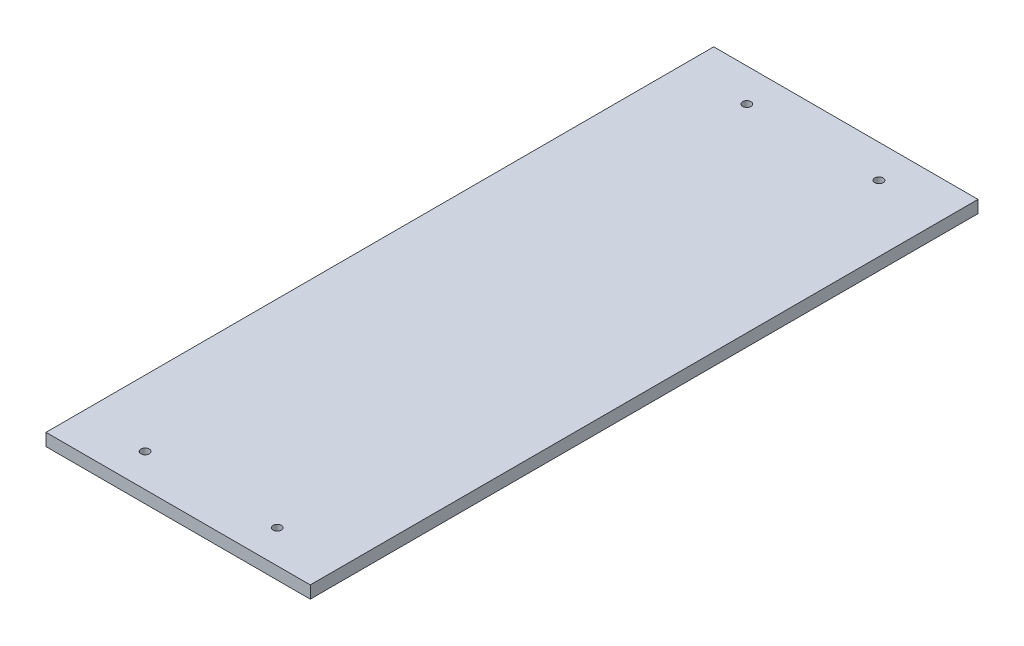
ISO-10303-21;
HEADER;
FILE_DESCRIPTION(('STEP AP214'),'2;1');
FILE_NAME('part.step','',(''),(''),'','','');
FILE_SCHEMA(('AUTOMOTIVE_DESIGN { 1 0 10303 214 1 1 1 1 }'));
ENDSEC;
DATA;
#1=APPLICATION_CONTEXT('core data for automotive mechanical design processes');
#2=APPLICATION_PROTOCOL_DEFINITION('international standard','automotive_design',2000,#1);
#3=PRODUCT_CONTEXT('',#1,'mechanical');
#4=PRODUCT('Part','Part','',(#3));
#5=PRODUCT_RELATED_PRODUCT_CATEGORY('part','',(#4));
#6=PRODUCT_DEFINITION_FORMATION('','',#4);
#7=PRODUCT_DEFINITION_CONTEXT('part definition',#1,'design');
#8=PRODUCT_DEFINITION('design','',#6,#7);
#9=PRODUCT_DEFINITION_SHAPE('','',#8);
#10=(LENGTH_UNIT() NAMED_UNIT(*) SI_UNIT(.MILLI.,.METRE.));
#11=(NAMED_UNIT(*) PLANE_ANGLE_UNIT() SI_UNIT($,.RADIAN.));
#12=(NAMED_UNIT(*) SI_UNIT($,.STERADIAN.) SOLID_ANGLE_UNIT());
#13=UNCERTAINTY_MEASURE_WITH_UNIT(LENGTH_MEASURE(1.E-05),#10,'distance_accuracy_value','');
#14=(GEOMETRIC_REPRESENTATION_CONTEXT(3) GLOBAL_UNCERTAINTY_ASSIGNED_CONTEXT((#13)) GLOBAL_UNIT_ASSIGNED_CONTEXT((#10,
#11,#12)) REPRESENTATION_CONTEXT('',''));
#15=CARTESIAN_POINT('',(0.,0.,0.));
#16=DIRECTION('',(0.,0.,1.));
#17=DIRECTION('',(1.,0.,0.));
#18=AXIS2_PLACEMENT_3D('',#15,#16,#17);
#19=CARTESIAN_POINT('',(-152.4,-9.525,304.8));
#20=DIRECTION('',(0.,0.,1.));
#21=DIRECTION('',(1.,0.,0.));
#22=AXIS2_PLACEMENT_3D('',#19,#20,#21);
#23=PLANE('',#22);
#24=DIRECTION('',(1.,0.,0.));
#25=VECTOR('',#24,1.);
#26=CARTESIAN_POINT('',(-152.4,-9.525,304.8));
#27=LINE('',#26,#25);
#28=CARTESIAN_POINT('',(-101.6,-9.525,304.8));
#29=VERTEX_POINT('',#28);
#30=CARTESIAN_POINT('',(101.6,-9.525,304.8));
#31=VERTEX_POINT('',#30);
#32=EDGE_CURVE('E53',#29,#31,#27,.T.);
#33=ORIENTED_EDGE('',*,*,#32,.T.);
#34=DIRECTION('',(0.,-1.,0.));
#35=VECTOR('',#34,1.);
#36=CARTESIAN_POINT('',(101.6,32.131,304.8));
#37=LINE('',#36,#35);
#38=CARTESIAN_POINT('',(101.6,0.,304.8));
#39=VERTEX_POINT('',#38);
#40=EDGE_CURVE('E83',#39,#31,#37,.T.);
#41=ORIENTED_EDGE('',*,*,#40,.F.);
#42=DIRECTION('',(1.,0.,0.));
#43=VECTOR('',#42,1.);
#44=CARTESIAN_POINT('',(-152.4,0.,304.8));
#45=LINE('',#44,#43);
#46=CARTESIAN_POINT('',(-101.6,0.,304.8));
#47=VERTEX_POINT('',#46);
#48=EDGE_CURVE('E105',#47,#39,#45,.T.);
#49=ORIENTED_EDGE('',*,*,#48,.F.);
#50=DIRECTION('',(0.,-1.,0.));
#51=VECTOR('',#50,1.);
#52=CARTESIAN_POINT('',(-101.6,32.131,304.8));
#53=LINE('',#52,#51);
#54=EDGE_CURVE('E101',#47,#29,#53,.T.);
#55=ORIENTED_EDGE('',*,*,#54,.T.);
#56=EDGE_LOOP('',(#33,#41,#49,#55));
#57=FACE_BOUND('',#56,.T.);
#58=ADVANCED_FACE('F45',(#57),#23,.T.);
#59=CARTESIAN_POINT('',(0.,-9.525,0.));
#60=DIRECTION('',(0.,1.,0.));
#61=DIRECTION('',(0.,0.,1.));
#62=AXIS2_PLACEMENT_3D('',#59,#60,#61);
#63=PLANE('',#62);
#64=CARTESIAN_POINT('',(50.833590000005,-9.525,-183.261));
#65=DIRECTION('',(0.,-1.,0.));
#66=DIRECTION('',(0.,0.,-1.));
#67=AXIS2_PLACEMENT_3D('',#64,#65,#66);
#68=CIRCLE('',#67,3.2258);
#69=CARTESIAN_POINT('',(50.833590000005,-9.525,-186.4868));
#70=VERTEX_POINT('',#69);
#71=EDGE_CURVE('E116',#70,#70,#68,.T.);
#72=ORIENTED_EDGE('',*,*,#71,.F.);
#73=EDGE_LOOP('',(#72));
#74=FACE_BOUND('',#73,.T.);
#75=CARTESIAN_POINT('',(-50.7664099999951,-9.525,-183.261));
#76=DIRECTION('',(0.,-1.,0.));
#77=DIRECTION('',(0.,0.,1.));
#78=AXIS2_PLACEMENT_3D('',#75,#76,#77);
#79=CIRCLE('',#78,3.2258);
#80=CARTESIAN_POINT('',(-50.7664099999951,-9.525,-180.0352));
#81=VERTEX_POINT('',#80);
#82=EDGE_CURVE('E120',#81,#81,#79,.T.);
#83=ORIENTED_EDGE('',*,*,#82,.F.);
#84=EDGE_LOOP('',(#83));
#85=FACE_BOUND('',#84,.T.);
#86=CARTESIAN_POINT('',(-50.7664099999951,-9.525,279.4));
#87=DIRECTION('',(0.,-1.,0.));
#88=DIRECTION('',(0.,0.,-1.));
#89=AXIS2_PLACEMENT_3D('',#86,#87,#88);
#90=CIRCLE('',#89,3.2258);
#91=CARTESIAN_POINT('',(-50.7664099999951,-9.525,276.1742));
#92=VERTEX_POINT('',#91);
#93=EDGE_CURVE('E136',#92,#92,#90,.T.);
#94=ORIENTED_EDGE('',*,*,#93,.F.);
#95=EDGE_LOOP('',(#94));
#96=FACE_BOUND('',#95,.T.);
#97=CARTESIAN_POINT('',(50.833590000005,-9.525,279.4));
#98=DIRECTION('',(0.,-1.,0.));
#99=DIRECTION('',(0.,0.,1.));
#100=AXIS2_PLACEMENT_3D('',#97,#98,#99);
#101=CIRCLE('',#100,3.2258);
#102=CARTESIAN_POINT('',(50.833590000005,-9.525,282.6258));
#103=VERTEX_POINT('',#102);
#104=EDGE_CURVE('E128',#103,#103,#101,.T.);
#105=ORIENTED_EDGE('',*,*,#104,.F.);
#106=EDGE_LOOP('',(#105));
#107=FACE_BOUND('',#106,.T.);
#108=DIRECTION('',(0.,0.,1.));
#109=VECTOR('',#108,1.);
#110=CARTESIAN_POINT('',(101.6,-9.525,0.));
#111=LINE('',#110,#109);
#112=CARTESIAN_POINT('',(101.6,-9.525,-208.661));
#113=VERTEX_POINT('',#112);
#114=EDGE_CURVE('E59',#113,#31,#111,.T.);
#115=ORIENTED_EDGE('',*,*,#114,.T.);
#116=ORIENTED_EDGE('',*,*,#32,.F.);
#117=DIRECTION('',(0.,0.,1.));
#118=VECTOR('',#117,1.);
#119=CARTESIAN_POINT('',(-101.6,-9.525,0.));
#120=LINE('',#119,#118);
#121=CARTESIAN_POINT('',(-101.6,-9.525,-208.661));
#122=VERTEX_POINT('',#121);
#123=EDGE_CURVE('E154',#122,#29,#120,.T.);
#124=ORIENTED_EDGE('',*,*,#123,.F.);
#125=DIRECTION('',(1.,0.,0.));
#126=VECTOR('',#125,1.);
#127=CARTESIAN_POINT('',(0.,-9.525,-208.661));
#128=LINE('',#127,#126);
#129=EDGE_CURVE('E99',#122,#113,#128,.T.);
#130=ORIENTED_EDGE('',*,*,#129,.T.);
#131=EDGE_LOOP('',(#115,#116,#124,#130));
#132=FACE_BOUND('',#131,.T.);
#133=ADVANCED_FACE('F96',(#74,#85,#96,#107,#132),#63,.F.);
#134=CARTESIAN_POINT('',(0.,0.,0.));
#135=DIRECTION('',(0.,1.,0.));
#136=DIRECTION('',(0.,0.,1.));
#137=AXIS2_PLACEMENT_3D('',#134,#135,#136);
#138=PLANE('',#137);
#139=CARTESIAN_POINT('',(50.833590000005,0.,279.4));
#140=DIRECTION('',(0.,-1.,0.));
#141=DIRECTION('',(0.,0.,1.));
#142=AXIS2_PLACEMENT_3D('',#139,#140,#141);
#143=CIRCLE('',#142,3.2258);
#144=CARTESIAN_POINT('',(50.833590000005,0.,282.6258));
#145=VERTEX_POINT('',#144);
#146=EDGE_CURVE('E124',#145,#145,#143,.T.);
#147=ORIENTED_EDGE('',*,*,#146,.T.);
#148=EDGE_LOOP('',(#147));
#149=FACE_BOUND('',#148,.T.);
#150=CARTESIAN_POINT('',(-50.7664099999951,0.,279.4));
#151=DIRECTION('',(0.,-1.,0.));
#152=DIRECTION('',(0.,0.,-1.));
#153=AXIS2_PLACEMENT_3D('',#150,#151,#152);
#154=CIRCLE('',#153,3.2258);
#155=CARTESIAN_POINT('',(-50.7664099999951,0.,276.1742));
#156=VERTEX_POINT('',#155);
#157=EDGE_CURVE('E132',#156,#156,#154,.T.);
#158=ORIENTED_EDGE('',*,*,#157,.T.);
#159=EDGE_LOOP('',(#158));
#160=FACE_BOUND('',#159,.T.);
#161=CARTESIAN_POINT('',(-50.7664099999951,0.,-183.261));
#162=DIRECTION('',(0.,-1.,0.));
#163=DIRECTION('',(0.,0.,1.));
#164=AXIS2_PLACEMENT_3D('',#161,#162,#163);
#165=CIRCLE('',#164,3.2258);
#166=CARTESIAN_POINT('',(-50.7664099999951,0.,-180.0352));
#167=VERTEX_POINT('',#166);
#168=EDGE_CURVE('E140',#167,#167,#165,.T.);
#169=ORIENTED_EDGE('',*,*,#168,.T.);
#170=EDGE_LOOP('',(#169));
#171=FACE_BOUND('',#170,.T.);
#172=CARTESIAN_POINT('',(50.833590000005,0.,-183.261));
#173=DIRECTION('',(0.,-1.,0.));
#174=DIRECTION('',(0.,0.,-1.));
#175=AXIS2_PLACEMENT_3D('',#172,#173,#174);
#176=CIRCLE('',#175,3.2258);
#177=CARTESIAN_POINT('',(50.833590000005,0.,-186.4868));
#178=VERTEX_POINT('',#177);
#179=EDGE_CURVE('E115',#178,#178,#176,.T.);
#180=ORIENTED_EDGE('',*,*,#179,.T.);
#181=EDGE_LOOP('',(#180));
#182=FACE_BOUND('',#181,.T.);
#183=ORIENTED_EDGE('',*,*,#48,.T.);
#184=DIRECTION('',(0.,0.,-1.));
#185=VECTOR('',#184,1.);
#186=CARTESIAN_POINT('',(101.6,0.,0.));
#187=LINE('',#186,#185);
#188=CARTESIAN_POINT('',(101.6,0.,-208.661));
#189=VERTEX_POINT('',#188);
#190=EDGE_CURVE('E86',#39,#189,#187,.T.);
#191=ORIENTED_EDGE('',*,*,#190,.T.);
#192=DIRECTION('',(1.,0.,0.));
#193=VECTOR('',#192,1.);
#194=CARTESIAN_POINT('',(-120.245,0.,-208.661));
#195=LINE('',#194,#193);
#196=CARTESIAN_POINT('',(-101.6,0.,-208.661));
#197=VERTEX_POINT('',#196);
#198=EDGE_CURVE('E111',#197,#189,#195,.T.);
#199=ORIENTED_EDGE('',*,*,#198,.F.);
#200=DIRECTION('',(0.,0.,-1.));
#201=VECTOR('',#200,1.);
#202=CARTESIAN_POINT('',(-101.6,0.,0.));
#203=LINE('',#202,#201);
#204=EDGE_CURVE('E67',#47,#197,#203,.T.);
#205=ORIENTED_EDGE('',*,*,#204,.F.);
#206=EDGE_LOOP('',(#183,#191,#199,#205));
#207=FACE_BOUND('',#206,.T.);
#208=ADVANCED_FACE('F163',(#149,#160,#171,#182,#207),#138,.T.);
#209=CARTESIAN_POINT('',(-120.245,-15.24,-208.661));
#210=DIRECTION('',(0.,0.,1.));
#211=DIRECTION('',(1.,0.,0.));
#212=AXIS2_PLACEMENT_3D('',#209,#210,#211);
#213=PLANE('',#212);
#214=DIRECTION('',(0.,1.,0.));
#215=VECTOR('',#214,1.);
#216=CARTESIAN_POINT('',(101.6,-15.24,-208.661));
#217=LINE('',#216,#215);
#218=EDGE_CURVE('E11',#113,#189,#217,.T.);
#219=ORIENTED_EDGE('',*,*,#218,.F.);
#220=ORIENTED_EDGE('',*,*,#129,.F.);
#221=DIRECTION('',(0.,-1.,0.));
#222=VECTOR('',#221,1.);
#223=CARTESIAN_POINT('',(-101.6,32.131,-208.661));
#224=LINE('',#223,#222);
#225=EDGE_CURVE('E151',#197,#122,#224,.T.);
#226=ORIENTED_EDGE('',*,*,#225,.F.);
#227=ORIENTED_EDGE('',*,*,#198,.T.);
#228=EDGE_LOOP('',(#219,#220,#226,#227));
#229=FACE_BOUND('',#228,.T.);
#230=ADVANCED_FACE('F160',(#229),#213,.F.);
#231=CARTESIAN_POINT('',(50.833590000005,0.,-183.261));
#232=DIRECTION('',(0.,-1.,0.));
#233=DIRECTION('',(0.,0.,-1.));
#234=AXIS2_PLACEMENT_3D('',#231,#232,#233);
#235=CYLINDRICAL_SURFACE('',#234,3.2258);
#236=ORIENTED_EDGE('',*,*,#179,.F.);
#237=EDGE_LOOP('',(#236));
#238=FACE_BOUND('',#237,.T.);
#239=ORIENTED_EDGE('',*,*,#71,.T.);
#240=EDGE_LOOP('',(#239));
#241=FACE_BOUND('',#240,.T.);
#242=ADVANCED_FACE('F170',(#238,#241),#235,.F.);
#243=CARTESIAN_POINT('',(-50.7664099999951,0.,-183.261));
#244=DIRECTION('',(0.,-1.,0.));
#245=DIRECTION('',(0.,0.,-1.));
#246=AXIS2_PLACEMENT_3D('',#243,#244,#245);
#247=CYLINDRICAL_SURFACE('',#246,3.2258);
#248=ORIENTED_EDGE('',*,*,#168,.F.);
#249=EDGE_LOOP('',(#248));
#250=FACE_BOUND('',#249,.T.);
#251=ORIENTED_EDGE('',*,*,#82,.T.);
#252=EDGE_LOOP('',(#251));
#253=FACE_BOUND('',#252,.T.);
#254=ADVANCED_FACE('F228',(#250,#253),#247,.F.);
#255=CARTESIAN_POINT('',(-50.7664099999951,0.,279.4));
#256=DIRECTION('',(0.,-1.,0.));
#257=DIRECTION('',(0.,0.,-1.));
#258=AXIS2_PLACEMENT_3D('',#255,#256,#257);
#259=CYLINDRICAL_SURFACE('',#258,3.2258);
#260=ORIENTED_EDGE('',*,*,#157,.F.);
#261=EDGE_LOOP('',(#260));
#262=FACE_BOUND('',#261,.T.);
#263=ORIENTED_EDGE('',*,*,#93,.T.);
#264=EDGE_LOOP('',(#263));
#265=FACE_BOUND('',#264,.T.);
#266=ADVANCED_FACE('F220',(#262,#265),#259,.F.);
#267=CARTESIAN_POINT('',(50.833590000005,0.,279.4));
#268=DIRECTION('',(0.,-1.,0.));
#269=DIRECTION('',(0.,0.,-1.));
#270=AXIS2_PLACEMENT_3D('',#267,#268,#269);
#271=CYLINDRICAL_SURFACE('',#270,3.2258);
#272=ORIENTED_EDGE('',*,*,#146,.F.);
#273=EDGE_LOOP('',(#272));
#274=FACE_BOUND('',#273,.T.);
#275=ORIENTED_EDGE('',*,*,#104,.T.);
#276=EDGE_LOOP('',(#275));
#277=FACE_BOUND('',#276,.T.);
#278=ADVANCED_FACE('F184',(#274,#277),#271,.F.);
#279=CARTESIAN_POINT('',(-101.6,32.131,0.));
#280=DIRECTION('',(1.,0.,0.));
#281=DIRECTION('',(0.,0.,-1.));
#282=AXIS2_PLACEMENT_3D('',#279,#280,#281);
#283=PLANE('',#282);
#284=ORIENTED_EDGE('',*,*,#204,.T.);
#285=ORIENTED_EDGE('',*,*,#225,.T.);
#286=ORIENTED_EDGE('',*,*,#123,.T.);
#287=ORIENTED_EDGE('',*,*,#54,.F.);
#288=EDGE_LOOP('',(#284,#285,#286,#287));
#289=FACE_BOUND('',#288,.T.);
#290=ADVANCED_FACE('F158',(#289),#283,.F.);
#291=CARTESIAN_POINT('',(101.6,32.131,0.));
#292=DIRECTION('',(1.,0.,0.));
#293=DIRECTION('',(0.,0.,-1.));
#294=AXIS2_PLACEMENT_3D('',#291,#292,#293);
#295=PLANE('',#294);
#296=ORIENTED_EDGE('',*,*,#40,.T.);
#297=ORIENTED_EDGE('',*,*,#114,.F.);
#298=ORIENTED_EDGE('',*,*,#218,.T.);
#299=ORIENTED_EDGE('',*,*,#190,.F.);
#300=EDGE_LOOP('',(#296,#297,#298,#299));
#301=FACE_BOUND('',#300,.T.);
#302=ADVANCED_FACE('F84',(#301),#295,.T.);
#303=CLOSED_SHELL('',(#58,#133,#208,#230,#242,#254,#266,#278,#290,#302));
#304=MANIFOLD_SOLID_BREP('B2',#303);
#305=ADVANCED_BREP_SHAPE_REPRESENTATION('',(#18,#304),#14);
#306=SHAPE_DEFINITION_REPRESENTATION(#9,#305);
ENDSEC;
END-ISO-10303-21;
